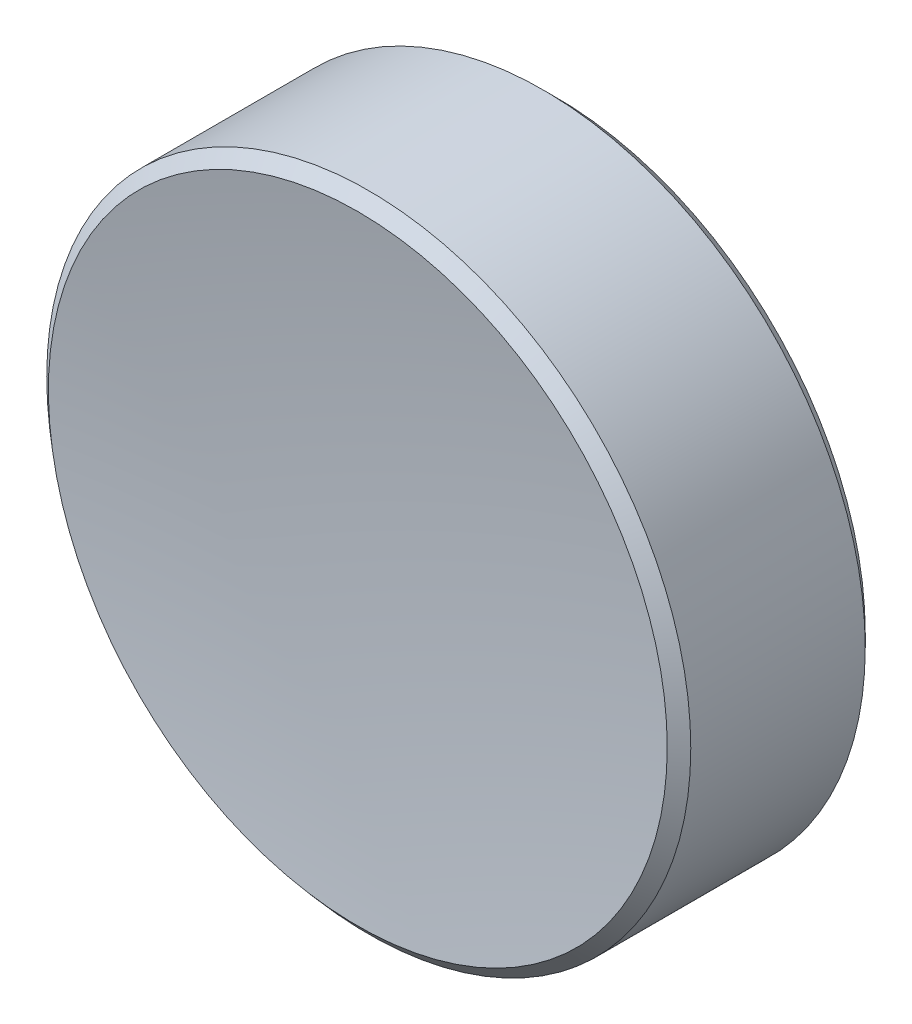
ISO-10303-21;
HEADER;
FILE_DESCRIPTION(('STEP AP214'),'2;1');
FILE_NAME('part.step','',(''),(''),'','','');
FILE_SCHEMA(('AUTOMOTIVE_DESIGN { 1 0 10303 214 1 1 1 1 }'));
ENDSEC;
DATA;
#1=APPLICATION_CONTEXT('core data for automotive mechanical design processes');
#2=APPLICATION_PROTOCOL_DEFINITION('international standard','automotive_design',2000,#1);
#3=PRODUCT_CONTEXT('',#1,'mechanical');
#4=PRODUCT('Part','Part','',(#3));
#5=PRODUCT_RELATED_PRODUCT_CATEGORY('part','',(#4));
#6=PRODUCT_DEFINITION_FORMATION('','',#4);
#7=PRODUCT_DEFINITION_CONTEXT('part definition',#1,'design');
#8=PRODUCT_DEFINITION('design','',#6,#7);
#9=PRODUCT_DEFINITION_SHAPE('','',#8);
#10=(LENGTH_UNIT() NAMED_UNIT(*) SI_UNIT(.MILLI.,.METRE.));
#11=(NAMED_UNIT(*) PLANE_ANGLE_UNIT() SI_UNIT($,.RADIAN.));
#12=(NAMED_UNIT(*) SI_UNIT($,.STERADIAN.) SOLID_ANGLE_UNIT());
#13=UNCERTAINTY_MEASURE_WITH_UNIT(LENGTH_MEASURE(1.E-05),#10,'distance_accuracy_value','');
#14=(GEOMETRIC_REPRESENTATION_CONTEXT(3) GLOBAL_UNCERTAINTY_ASSIGNED_CONTEXT((#13)) GLOBAL_UNIT_ASSIGNED_CONTEXT((#10,
#11,#12)) REPRESENTATION_CONTEXT('',''));
#15=CARTESIAN_POINT('',(0.,0.,0.));
#16=DIRECTION('',(0.,0.,1.));
#17=DIRECTION('',(1.,0.,0.));
#18=AXIS2_PLACEMENT_3D('',#15,#16,#17);
#19=CARTESIAN_POINT('',(0.,0.,47.5467603204443));
#20=DIRECTION('',(0.,0.,1.));
#21=DIRECTION('',(0.,1.,0.));
#22=AXIS2_PLACEMENT_3D('',#19,#20,#21);
#23=SPHERICAL_SURFACE('',#22,46.);
#24=CARTESIAN_POINT('',(0.,0.,1.95323967955565));
#25=DIRECTION('',(0.,0.,1.));
#26=DIRECTION('',(1.,0.,0.));
#27=AXIS2_PLACEMENT_3D('',#24,#25,#26);
#28=CIRCLE('',#27,6.10171087227642);
#29=CARTESIAN_POINT('',(6.10171087227642,0.,1.95323967955565));
#30=VERTEX_POINT('',#29);
#31=EDGE_CURVE('E9',#30,#30,#28,.T.);
#32=ORIENTED_EDGE('',*,*,#31,.T.);
#33=EDGE_LOOP('',(#32));
#34=FACE_BOUND('',#33,.T.);
#35=ADVANCED_FACE('F13',(#34),#23,.F.);
#36=CARTESIAN_POINT('',(0.,0.,1.54676032044435));
#37=DIRECTION('',(0.,0.,1.));
#38=DIRECTION('',(1.,0.,0.));
#39=AXIS2_PLACEMENT_3D('',#36,#37,#38);
#40=CYLINDRICAL_SURFACE('',#39,6.35);
#41=CARTESIAN_POINT('',(0.,0.,-1.70323967955565));
#42=DIRECTION('',(0.,0.,1.));
#43=DIRECTION('',(1.,0.,0.));
#44=AXIS2_PLACEMENT_3D('',#41,#42,#43);
#45=CIRCLE('',#44,6.35);
#46=CARTESIAN_POINT('',(6.35,0.,-1.70323967955565));
#47=VERTEX_POINT('',#46);
#48=EDGE_CURVE('E24',#47,#47,#45,.T.);
#49=ORIENTED_EDGE('',*,*,#48,.T.);
#50=EDGE_LOOP('',(#49));
#51=FACE_BOUND('',#50,.T.);
#52=CARTESIAN_POINT('',(0.,0.,1.73715650302731));
#53=DIRECTION('',(0.,0.,-1.));
#54=DIRECTION('',(-1.,0.,0.));
#55=AXIS2_PLACEMENT_3D('',#52,#53,#54);
#56=CIRCLE('',#55,6.35);
#57=CARTESIAN_POINT('',(-6.35,0.,1.73715650302731));
#58=VERTEX_POINT('',#57);
#59=EDGE_CURVE('E28',#58,#58,#56,.T.);
#60=ORIENTED_EDGE('',*,*,#59,.T.);
#61=EDGE_LOOP('',(#60));
#62=FACE_BOUND('',#61,.T.);
#63=ADVANCED_FACE('F34',(#51,#62),#40,.T.);
#64=CARTESIAN_POINT('',(0.,0.,-1.95323967955565));
#65=DIRECTION('',(0.,0.,1.));
#66=DIRECTION('',(1.,0.,0.));
#67=AXIS2_PLACEMENT_3D('',#64,#65,#66);
#68=PLANE('',#67);
#69=CARTESIAN_POINT('',(0.,0.,-1.95323967955565));
#70=DIRECTION('',(0.,0.,1.));
#71=DIRECTION('',(1.,0.,0.));
#72=AXIS2_PLACEMENT_3D('',#69,#70,#71);
#73=CIRCLE('',#72,6.1);
#74=CARTESIAN_POINT('',(6.1,0.,-1.95323967955565));
#75=VERTEX_POINT('',#74);
#76=EDGE_CURVE('E20',#75,#75,#73,.F.);
#77=ORIENTED_EDGE('',*,*,#76,.T.);
#78=EDGE_LOOP('',(#77));
#79=FACE_BOUND('',#78,.T.);
#80=ADVANCED_FACE('F43',(#79),#68,.F.);
#81=CARTESIAN_POINT('',(0.,0.,-1.70323967955565));
#82=DIRECTION('',(0.,0.,1.));
#83=DIRECTION('',(1.,0.,0.));
#84=AXIS2_PLACEMENT_3D('',#81,#82,#83);
#85=CONICAL_SURFACE('',#84,6.35,0.78539816339745);
#86=ORIENTED_EDGE('',*,*,#76,.F.);
#87=EDGE_LOOP('',(#86));
#88=FACE_BOUND('',#87,.T.);
#89=ORIENTED_EDGE('',*,*,#48,.F.);
#90=EDGE_LOOP('',(#89));
#91=FACE_BOUND('',#90,.T.);
#92=ADVANCED_FACE('F38',(#88,#91),#85,.T.);
#93=CARTESIAN_POINT('',(0.,0.,1.95323967955565));
#94=DIRECTION('',(0.,0.,-1.));
#95=DIRECTION('',(-1.,0.,0.));
#96=AXIS2_PLACEMENT_3D('',#93,#94,#95);
#97=CONICAL_SURFACE('',#96,6.10171087227642,0.854641016991883);
#98=ORIENTED_EDGE('',*,*,#59,.F.);
#99=EDGE_LOOP('',(#98));
#100=FACE_BOUND('',#99,.T.);
#101=ORIENTED_EDGE('',*,*,#31,.F.);
#102=EDGE_LOOP('',(#101));
#103=FACE_BOUND('',#102,.T.);
#104=ADVANCED_FACE('F15',(#100,#103),#97,.T.);
#105=CLOSED_SHELL('',(#35,#63,#80,#92,#104));
#106=MANIFOLD_SOLID_BREP('B1',#105);
#107=ADVANCED_BREP_SHAPE_REPRESENTATION('',(#18,#106),#14);
#108=SHAPE_DEFINITION_REPRESENTATION(#9,#107);
ENDSEC;
END-ISO-10303-21;
